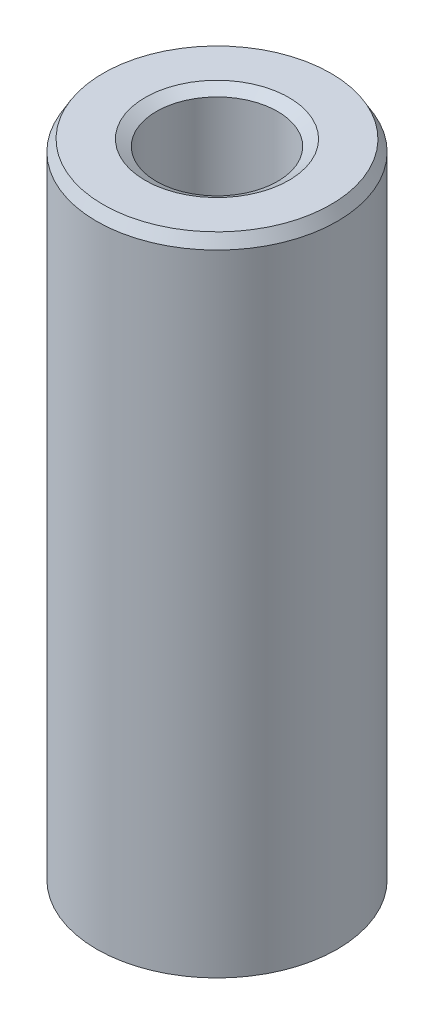
ISO-10303-21;
HEADER;
FILE_DESCRIPTION(('STEP AP214'),'2;1');
FILE_NAME('part.step','',(''),(''),'','','');
FILE_SCHEMA(('AUTOMOTIVE_DESIGN { 1 0 10303 214 1 1 1 1 }'));
ENDSEC;
DATA;
#1=APPLICATION_CONTEXT('core data for automotive mechanical design processes');
#2=APPLICATION_PROTOCOL_DEFINITION('international standard','automotive_design',2000,#1);
#3=PRODUCT_CONTEXT('',#1,'mechanical');
#4=PRODUCT('Part','Part','',(#3));
#5=PRODUCT_RELATED_PRODUCT_CATEGORY('part','',(#4));
#6=PRODUCT_DEFINITION_FORMATION('','',#4);
#7=PRODUCT_DEFINITION_CONTEXT('part definition',#1,'design');
#8=PRODUCT_DEFINITION('design','',#6,#7);
#9=PRODUCT_DEFINITION_SHAPE('','',#8);
#10=(LENGTH_UNIT() NAMED_UNIT(*) SI_UNIT(.MILLI.,.METRE.));
#11=(NAMED_UNIT(*) PLANE_ANGLE_UNIT() SI_UNIT($,.RADIAN.));
#12=(NAMED_UNIT(*) SI_UNIT($,.STERADIAN.) SOLID_ANGLE_UNIT());
#13=UNCERTAINTY_MEASURE_WITH_UNIT(LENGTH_MEASURE(1.E-05),#10,'distance_accuracy_value','');
#14=(GEOMETRIC_REPRESENTATION_CONTEXT(3) GLOBAL_UNCERTAINTY_ASSIGNED_CONTEXT((#13)) GLOBAL_UNIT_ASSIGNED_CONTEXT((#10,
#11,#12)) REPRESENTATION_CONTEXT('',''));
#15=CARTESIAN_POINT('',(0.,0.,0.));
#16=DIRECTION('',(0.,0.,1.));
#17=DIRECTION('',(1.,0.,0.));
#18=AXIS2_PLACEMENT_3D('',#15,#16,#17);
#19=CARTESIAN_POINT('',(0.,53.862137515395,0.));
#20=DIRECTION('',(0.,-1.,0.));
#21=DIRECTION('',(0.,0.,-1.));
#22=AXIS2_PLACEMENT_3D('',#19,#20,#21);
#23=CYLINDRICAL_SURFACE('',#22,10.);
#24=CARTESIAN_POINT('',(0.,0.538601056028397,0.));
#25=DIRECTION('',(0.,1.,0.));
#26=DIRECTION('',(0.,0.,1.));
#27=AXIS2_PLACEMENT_3D('',#24,#25,#26);
#28=CIRCLE('',#27,10.);
#29=CARTESIAN_POINT('',(0.,0.538601056028397,10.));
#30=VERTEX_POINT('',#29);
#31=EDGE_CURVE('E10',#30,#30,#28,.T.);
#32=ORIENTED_EDGE('',*,*,#31,.T.);
#33=EDGE_LOOP('',(#32));
#34=FACE_BOUND('',#33,.T.);
#35=CARTESIAN_POINT('',(0.,52.9292531213436,0.));
#36=DIRECTION('',(0.,1.,0.));
#37=DIRECTION('',(0.,0.,1.));
#38=AXIS2_PLACEMENT_3D('',#35,#36,#37);
#39=CIRCLE('',#38,10.);
#40=CARTESIAN_POINT('',(0.,52.9292531213436,10.));
#41=VERTEX_POINT('',#40);
#42=EDGE_CURVE('E50',#41,#41,#39,.F.);
#43=ORIENTED_EDGE('',*,*,#42,.T.);
#44=EDGE_LOOP('',(#43));
#45=FACE_BOUND('',#44,.T.);
#46=ADVANCED_FACE('F39',(#34,#45),#23,.T.);
#47=CARTESIAN_POINT('',(0.,53.862137515395,0.));
#48=DIRECTION('',(0.,1.,0.));
#49=DIRECTION('',(0.,0.,1.));
#50=AXIS2_PLACEMENT_3D('',#47,#48,#49);
#51=PLANE('',#50);
#52=CARTESIAN_POINT('',(0.,53.862137515395,0.));
#53=DIRECTION('',(0.,1.,0.));
#54=DIRECTION('',(0.,0.,1.));
#55=AXIS2_PLACEMENT_3D('',#52,#53,#54);
#56=CIRCLE('',#55,5.9717706332526);
#57=CARTESIAN_POINT('',(0.,53.862137515395,5.9717706332526));
#58=VERTEX_POINT('',#57);
#59=EDGE_CURVE('E58',#58,#58,#56,.F.);
#60=ORIENTED_EDGE('',*,*,#59,.T.);
#61=EDGE_LOOP('',(#60));
#62=FACE_BOUND('',#61,.T.);
#63=CARTESIAN_POINT('',(0.,53.862137515395,0.));
#64=DIRECTION('',(0.,1.,0.));
#65=DIRECTION('',(0.,0.,1.));
#66=AXIS2_PLACEMENT_3D('',#63,#64,#65);
#67=CIRCLE('',#66,9.46139894397162);
#68=CARTESIAN_POINT('',(0.,53.862137515395,9.46139894397162));
#69=VERTEX_POINT('',#68);
#70=EDGE_CURVE('E61',#69,#69,#67,.T.);
#71=ORIENTED_EDGE('',*,*,#70,.T.);
#72=EDGE_LOOP('',(#71));
#73=FACE_BOUND('',#72,.T.);
#74=ADVANCED_FACE('F88',(#62,#73),#51,.T.);
#75=CARTESIAN_POINT('',(0.,0.,0.));
#76=DIRECTION('',(0.,1.,0.));
#77=DIRECTION('',(0.,0.,1.));
#78=AXIS2_PLACEMENT_3D('',#75,#76,#77);
#79=PLANE('',#78);
#80=CARTESIAN_POINT('',(0.,0.,0.));
#81=DIRECTION('',(0.,1.,0.));
#82=DIRECTION('',(0.,0.,1.));
#83=AXIS2_PLACEMENT_3D('',#80,#81,#82);
#84=CIRCLE('',#83,5.57748729522957);
#85=CARTESIAN_POINT('',(0.,0.,5.57748729522957));
#86=VERTEX_POINT('',#85);
#87=EDGE_CURVE('E51',#86,#86,#84,.T.);
#88=ORIENTED_EDGE('',*,*,#87,.T.);
#89=EDGE_LOOP('',(#88));
#90=FACE_BOUND('',#89,.T.);
#91=CARTESIAN_POINT('',(0.,0.,0.));
#92=DIRECTION('',(0.,1.,0.));
#93=DIRECTION('',(0.,0.,1.));
#94=AXIS2_PLACEMENT_3D('',#91,#92,#93);
#95=CIRCLE('',#94,9.06711560594857);
#96=CARTESIAN_POINT('',(0.,0.,9.06711560594857));
#97=VERTEX_POINT('',#96);
#98=EDGE_CURVE('E54',#97,#97,#95,.F.);
#99=ORIENTED_EDGE('',*,*,#98,.T.);
#100=EDGE_LOOP('',(#99));
#101=FACE_BOUND('',#100,.T.);
#102=ADVANCED_FACE('F83',(#90,#101),#79,.F.);
#103=CARTESIAN_POINT('',(0.,53.862137515395,0.));
#104=DIRECTION('',(0.,-1.,0.));
#105=DIRECTION('',(0.,0.,-1.));
#106=AXIS2_PLACEMENT_3D('',#103,#104,#105);
#107=CYLINDRICAL_SURFACE('',#106,5.03888623920118);
#108=CARTESIAN_POINT('',(0.,53.3235364593666,0.));
#109=DIRECTION('',(0.,1.,0.));
#110=DIRECTION('',(0.,0.,1.));
#111=AXIS2_PLACEMENT_3D('',#108,#109,#110);
#112=CIRCLE('',#111,5.03888623920118);
#113=CARTESIAN_POINT('',(0.,53.3235364593666,5.03888623920118));
#114=VERTEX_POINT('',#113);
#115=EDGE_CURVE('E67',#114,#114,#112,.T.);
#116=ORIENTED_EDGE('',*,*,#115,.T.);
#117=EDGE_LOOP('',(#116));
#118=FACE_BOUND('',#117,.T.);
#119=CARTESIAN_POINT('',(0.,0.932884394051432,0.));
#120=DIRECTION('',(0.,1.,0.));
#121=DIRECTION('',(0.,0.,1.));
#122=AXIS2_PLACEMENT_3D('',#119,#120,#121);
#123=CIRCLE('',#122,5.03888623920118);
#124=CARTESIAN_POINT('',(0.,0.932884394051432,5.03888623920118));
#125=VERTEX_POINT('',#124);
#126=EDGE_CURVE('E69',#125,#125,#123,.F.);
#127=ORIENTED_EDGE('',*,*,#126,.T.);
#128=EDGE_LOOP('',(#127));
#129=FACE_BOUND('',#128,.T.);
#130=ADVANCED_FACE('F71',(#118,#129),#107,.F.);
#131=CARTESIAN_POINT('',(0.,53.3235364593666,0.));
#132=DIRECTION('',(0.,1.,0.));
#133=DIRECTION('',(0.,0.,1.));
#134=AXIS2_PLACEMENT_3D('',#131,#132,#133);
#135=CONICAL_SURFACE('',#134,5.03888623920118,1.0471975511966);
#136=ORIENTED_EDGE('',*,*,#59,.F.);
#137=EDGE_LOOP('',(#136));
#138=FACE_BOUND('',#137,.T.);
#139=ORIENTED_EDGE('',*,*,#115,.F.);
#140=EDGE_LOOP('',(#139));
#141=FACE_BOUND('',#140,.T.);
#142=ADVANCED_FACE('F77',(#138,#141),#135,.F.);
#143=CARTESIAN_POINT('',(0.,0.,0.));
#144=DIRECTION('',(0.,-1.,0.));
#145=DIRECTION('',(0.,0.,-1.));
#146=AXIS2_PLACEMENT_3D('',#143,#144,#145);
#147=CONICAL_SURFACE('',#146,5.57748729522957,0.523598775598293);
#148=ORIENTED_EDGE('',*,*,#126,.F.);
#149=EDGE_LOOP('',(#148));
#150=FACE_BOUND('',#149,.T.);
#151=ORIENTED_EDGE('',*,*,#87,.F.);
#152=EDGE_LOOP('',(#151));
#153=FACE_BOUND('',#152,.T.);
#154=ADVANCED_FACE('F73',(#150,#153),#147,.F.);
#155=CARTESIAN_POINT('',(0.,0.538601056028397,0.));
#156=DIRECTION('',(0.,1.,0.));
#157=DIRECTION('',(0.,0.,1.));
#158=AXIS2_PLACEMENT_3D('',#155,#156,#157);
#159=CONICAL_SURFACE('',#158,10.,1.0471975511966);
#160=ORIENTED_EDGE('',*,*,#98,.F.);
#161=EDGE_LOOP('',(#160));
#162=FACE_BOUND('',#161,.T.);
#163=ORIENTED_EDGE('',*,*,#31,.F.);
#164=EDGE_LOOP('',(#163));
#165=FACE_BOUND('',#164,.T.);
#166=ADVANCED_FACE('F76',(#162,#165),#159,.T.);
#167=CARTESIAN_POINT('',(0.,53.862137515395,0.));
#168=DIRECTION('',(0.,-1.,0.));
#169=DIRECTION('',(0.,0.,-1.));
#170=AXIS2_PLACEMENT_3D('',#167,#168,#169);
#171=CONICAL_SURFACE('',#170,9.46139894397162,0.523598775598295);
#172=ORIENTED_EDGE('',*,*,#42,.F.);
#173=EDGE_LOOP('',(#172));
#174=FACE_BOUND('',#173,.T.);
#175=ORIENTED_EDGE('',*,*,#70,.F.);
#176=EDGE_LOOP('',(#175));
#177=FACE_BOUND('',#176,.T.);
#178=ADVANCED_FACE('F45',(#174,#177),#171,.T.);
#179=CLOSED_SHELL('',(#46,#74,#102,#130,#142,#154,#166,#178));
#180=MANIFOLD_SOLID_BREP('B2',#179);
#181=ADVANCED_BREP_SHAPE_REPRESENTATION('',(#18,#180),#14);
#182=SHAPE_DEFINITION_REPRESENTATION(#9,#181);
ENDSEC;
END-ISO-10303-21;
